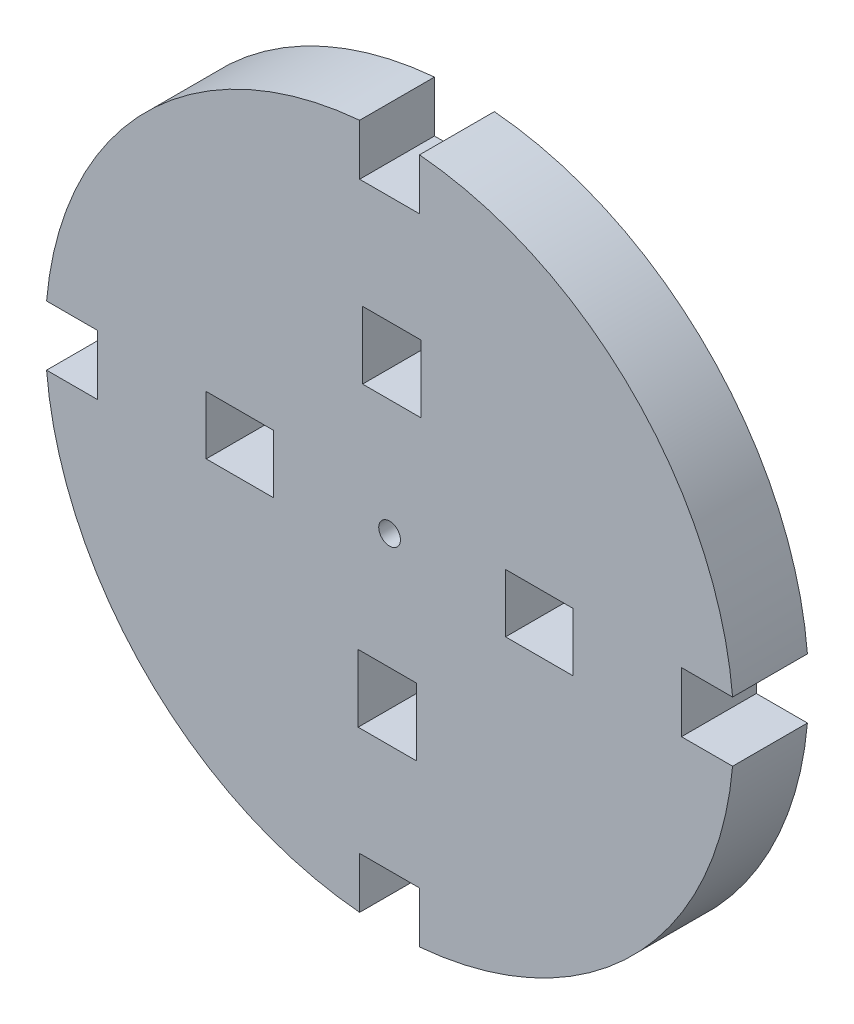
ISO-10303-21;
HEADER;
FILE_DESCRIPTION(('STEP AP214'),'2;1');
FILE_NAME('part.step','',(''),(''),'','','');
FILE_SCHEMA(('AUTOMOTIVE_DESIGN { 1 0 10303 214 1 1 1 1 }'));
ENDSEC;
DATA;
#1=APPLICATION_CONTEXT('core data for automotive mechanical design processes');
#2=APPLICATION_PROTOCOL_DEFINITION('international standard','automotive_design',2000,#1);
#3=PRODUCT_CONTEXT('',#1,'mechanical');
#4=PRODUCT('Part','Part','',(#3));
#5=PRODUCT_RELATED_PRODUCT_CATEGORY('part','',(#4));
#6=PRODUCT_DEFINITION_FORMATION('','',#4);
#7=PRODUCT_DEFINITION_CONTEXT('part definition',#1,'design');
#8=PRODUCT_DEFINITION('design','',#6,#7);
#9=PRODUCT_DEFINITION_SHAPE('','',#8);
#10=(LENGTH_UNIT() NAMED_UNIT(*) SI_UNIT(.MILLI.,.METRE.));
#11=(NAMED_UNIT(*) PLANE_ANGLE_UNIT() SI_UNIT($,.RADIAN.));
#12=(NAMED_UNIT(*) SI_UNIT($,.STERADIAN.) SOLID_ANGLE_UNIT());
#13=UNCERTAINTY_MEASURE_WITH_UNIT(LENGTH_MEASURE(1.E-05),#10,'distance_accuracy_value','');
#14=(GEOMETRIC_REPRESENTATION_CONTEXT(3) GLOBAL_UNCERTAINTY_ASSIGNED_CONTEXT((#13)) GLOBAL_UNIT_ASSIGNED_CONTEXT((#10,
#11,#12)) REPRESENTATION_CONTEXT('',''));
#15=CARTESIAN_POINT('',(0.,0.,0.));
#16=DIRECTION('',(0.,0.,1.));
#17=DIRECTION('',(1.,0.,0.));
#18=AXIS2_PLACEMENT_3D('',#15,#16,#17);
#19=CARTESIAN_POINT('',(0.,0.,5.));
#20=DIRECTION('',(0.,0.,-1.));
#21=DIRECTION('',(-1.,0.,0.));
#22=AXIS2_PLACEMENT_3D('',#19,#20,#21);
#23=CYLINDRICAL_SURFACE('',#22,23.);
#24=CARTESIAN_POINT('',(0.,0.,0.));
#25=DIRECTION('',(0.,0.,1.));
#26=DIRECTION('',(1.,0.,0.));
#27=AXIS2_PLACEMENT_3D('',#24,#25,#26);
#28=CIRCLE('',#27,23.);
#29=CARTESIAN_POINT('',(2.00000000000017,-22.9128784747792,0.));
#30=VERTEX_POINT('',#29);
#31=CARTESIAN_POINT('',(22.9128784747792,-1.99999999999992,0.));
#32=VERTEX_POINT('',#31);
#33=EDGE_CURVE('E501',#30,#32,#28,.T.);
#34=ORIENTED_EDGE('',*,*,#33,.T.);
#35=DIRECTION('',(0.,0.,-1.));
#36=VECTOR('',#35,1.);
#37=CARTESIAN_POINT('',(22.9128784747792,-1.99999999999992,5.));
#38=LINE('',#37,#36);
#39=CARTESIAN_POINT('',(22.9128784747792,-1.99999999999992,5.));
#40=VERTEX_POINT('',#39);
#41=EDGE_CURVE('E11',#32,#40,#38,.F.);
#42=ORIENTED_EDGE('',*,*,#41,.T.);
#43=CARTESIAN_POINT('',(0.,0.,5.));
#44=DIRECTION('',(0.,0.,1.));
#45=DIRECTION('',(1.,0.,0.));
#46=AXIS2_PLACEMENT_3D('',#43,#44,#45);
#47=CIRCLE('',#46,23.);
#48=CARTESIAN_POINT('',(2.00000000000017,-22.9128784747792,5.));
#49=VERTEX_POINT('',#48);
#50=EDGE_CURVE('E522',#49,#40,#47,.T.);
#51=ORIENTED_EDGE('',*,*,#50,.F.);
#52=DIRECTION('',(0.,0.,-1.));
#53=VECTOR('',#52,1.);
#54=CARTESIAN_POINT('',(2.00000000000017,-22.9128784747792,5.));
#55=LINE('',#54,#53);
#56=EDGE_CURVE('E489',#49,#30,#55,.T.);
#57=ORIENTED_EDGE('',*,*,#56,.T.);
#58=EDGE_LOOP('',(#34,#42,#51,#57));
#59=FACE_BOUND('',#58,.T.);
#60=ADVANCED_FACE('F33',(#59),#23,.T.);
#61=CARTESIAN_POINT('',(-22.9128784747792,-2.00000000000009,0.));
#62=VERTEX_POINT('',#61);
#63=CARTESIAN_POINT('',(-1.99999999999983,-22.9128784747792,0.));
#64=VERTEX_POINT('',#63);
#65=EDGE_CURVE('E477',#62,#64,#28,.T.);
#66=ORIENTED_EDGE('',*,*,#65,.T.);
#67=DIRECTION('',(0.,0.,-1.));
#68=VECTOR('',#67,1.);
#69=CARTESIAN_POINT('',(-1.99999999999983,-22.9128784747792,5.));
#70=LINE('',#69,#68);
#71=CARTESIAN_POINT('',(-1.99999999999983,-22.9128784747792,5.));
#72=VERTEX_POINT('',#71);
#73=EDGE_CURVE('E491',#64,#72,#70,.F.);
#74=ORIENTED_EDGE('',*,*,#73,.T.);
#75=CARTESIAN_POINT('',(-22.9128784747792,-2.00000000000009,5.));
#76=VERTEX_POINT('',#75);
#77=EDGE_CURVE('E472',#76,#72,#47,.T.);
#78=ORIENTED_EDGE('',*,*,#77,.F.);
#79=DIRECTION('',(0.,0.,-1.));
#80=VECTOR('',#79,1.);
#81=CARTESIAN_POINT('',(-22.9128784747792,-2.00000000000009,5.));
#82=LINE('',#81,#80);
#83=EDGE_CURVE('E483',#76,#62,#82,.T.);
#84=ORIENTED_EDGE('',*,*,#83,.T.);
#85=EDGE_LOOP('',(#66,#74,#78,#84));
#86=FACE_BOUND('',#85,.T.);
#87=ADVANCED_FACE('F508',(#86),#23,.T.);
#88=CARTESIAN_POINT('',(-2.,22.9128784747792,0.));
#89=VERTEX_POINT('',#88);
#90=CARTESIAN_POINT('',(-22.9128784747792,1.99999999999991,0.));
#91=VERTEX_POINT('',#90);
#92=EDGE_CURVE('E474',#89,#91,#28,.T.);
#93=ORIENTED_EDGE('',*,*,#92,.T.);
#94=DIRECTION('',(0.,0.,-1.));
#95=VECTOR('',#94,1.);
#96=CARTESIAN_POINT('',(-22.9128784747792,1.99999999999991,5.));
#97=LINE('',#96,#95);
#98=CARTESIAN_POINT('',(-22.9128784747792,1.99999999999991,5.));
#99=VERTEX_POINT('',#98);
#100=EDGE_CURVE('E486',#91,#99,#97,.F.);
#101=ORIENTED_EDGE('',*,*,#100,.T.);
#102=CARTESIAN_POINT('',(-2.,22.9128784747792,5.));
#103=VERTEX_POINT('',#102);
#104=EDGE_CURVE('E468',#103,#99,#47,.T.);
#105=ORIENTED_EDGE('',*,*,#104,.F.);
#106=DIRECTION('',(0.,0.,-1.));
#107=VECTOR('',#106,1.);
#108=CARTESIAN_POINT('',(-2.,22.9128784747792,5.));
#109=LINE('',#108,#107);
#110=EDGE_CURVE('E480',#103,#89,#109,.T.);
#111=ORIENTED_EDGE('',*,*,#110,.T.);
#112=EDGE_LOOP('',(#93,#101,#105,#111));
#113=FACE_BOUND('',#112,.T.);
#114=ADVANCED_FACE('F534',(#113),#23,.T.);
#115=CARTESIAN_POINT('',(0.,0.,5.));
#116=DIRECTION('',(0.,0.,1.));
#117=DIRECTION('',(1.,0.,0.));
#118=AXIS2_PLACEMENT_3D('',#115,#116,#117);
#119=PLANE('',#118);
#120=DIRECTION('',(-1.,0.,0.));
#121=VECTOR('',#120,1.);
#122=CARTESIAN_POINT('',(26.5000000000001,-1.99999999999992,5.));
#123=LINE('',#122,#121);
#124=CARTESIAN_POINT('',(19.5000000000001,-1.99999999999992,5.));
#125=VERTEX_POINT('',#124);
#126=EDGE_CURVE('E252',#40,#125,#123,.T.);
#127=ORIENTED_EDGE('',*,*,#126,.T.);
#128=DIRECTION('',(0.,1.,0.));
#129=VECTOR('',#128,1.);
#130=CARTESIAN_POINT('',(19.5000000000001,-1.99999999999992,5.));
#131=LINE('',#130,#129);
#132=CARTESIAN_POINT('',(19.5000000000001,2.00000000000008,5.));
#133=VERTEX_POINT('',#132);
#134=EDGE_CURVE('E247',#125,#133,#131,.T.);
#135=ORIENTED_EDGE('',*,*,#134,.T.);
#136=DIRECTION('',(1.,0.,0.));
#137=VECTOR('',#136,1.);
#138=CARTESIAN_POINT('',(26.5000000000001,2.00000000000008,5.));
#139=LINE('',#138,#137);
#140=CARTESIAN_POINT('',(22.9128784747792,2.00000000000008,5.));
#141=VERTEX_POINT('',#140);
#142=EDGE_CURVE('E255',#133,#141,#139,.T.);
#143=ORIENTED_EDGE('',*,*,#142,.T.);
#144=CARTESIAN_POINT('',(2.,22.9128784747792,5.));
#145=VERTEX_POINT('',#144);
#146=EDGE_CURVE('E473',#141,#145,#47,.T.);
#147=ORIENTED_EDGE('',*,*,#146,.T.);
#148=DIRECTION('',(0.,-1.,0.));
#149=VECTOR('',#148,1.);
#150=CARTESIAN_POINT('',(2.,26.5,5.));
#151=LINE('',#150,#149);
#152=CARTESIAN_POINT('',(2.,19.5,5.));
#153=VERTEX_POINT('',#152);
#154=EDGE_CURVE('E316',#145,#153,#151,.T.);
#155=ORIENTED_EDGE('',*,*,#154,.T.);
#156=DIRECTION('',(-1.,0.,0.));
#157=VECTOR('',#156,1.);
#158=CARTESIAN_POINT('',(2.,19.5,5.));
#159=LINE('',#158,#157);
#160=CARTESIAN_POINT('',(-2.,19.5,5.));
#161=VERTEX_POINT('',#160);
#162=EDGE_CURVE('E320',#153,#161,#159,.T.);
#163=ORIENTED_EDGE('',*,*,#162,.T.);
#164=DIRECTION('',(0.,1.,0.));
#165=VECTOR('',#164,1.);
#166=CARTESIAN_POINT('',(-2.,26.5,5.));
#167=LINE('',#166,#165);
#168=EDGE_CURVE('E313',#161,#103,#167,.T.);
#169=ORIENTED_EDGE('',*,*,#168,.T.);
#170=ORIENTED_EDGE('',*,*,#104,.T.);
#171=DIRECTION('',(1.,0.,0.));
#172=VECTOR('',#171,1.);
#173=CARTESIAN_POINT('',(-26.4999999999999,1.99999999999991,5.));
#174=LINE('',#173,#172);
#175=CARTESIAN_POINT('',(-19.4999999999999,1.99999999999991,5.));
#176=VERTEX_POINT('',#175);
#177=EDGE_CURVE('E299',#99,#176,#174,.T.);
#178=ORIENTED_EDGE('',*,*,#177,.T.);
#179=DIRECTION('',(0.,-1.,0.));
#180=VECTOR('',#179,1.);
#181=CARTESIAN_POINT('',(-19.4999999999999,1.99999999999991,5.));
#182=LINE('',#181,#180);
#183=CARTESIAN_POINT('',(-19.4999999999999,-2.00000000000009,5.));
#184=VERTEX_POINT('',#183);
#185=EDGE_CURVE('E292',#176,#184,#182,.T.);
#186=ORIENTED_EDGE('',*,*,#185,.T.);
#187=DIRECTION('',(-1.,0.,0.));
#188=VECTOR('',#187,1.);
#189=CARTESIAN_POINT('',(-26.4999999999999,-2.00000000000009,5.));
#190=LINE('',#189,#188);
#191=EDGE_CURVE('E295',#184,#76,#190,.T.);
#192=ORIENTED_EDGE('',*,*,#191,.T.);
#193=ORIENTED_EDGE('',*,*,#77,.T.);
#194=DIRECTION('',(0.,1.,0.));
#195=VECTOR('',#194,1.);
#196=CARTESIAN_POINT('',(-1.99999999999983,-26.5,5.));
#197=LINE('',#196,#195);
#198=CARTESIAN_POINT('',(-1.99999999999983,-19.5,5.));
#199=VERTEX_POINT('',#198);
#200=EDGE_CURVE('E279',#72,#199,#197,.T.);
#201=ORIENTED_EDGE('',*,*,#200,.T.);
#202=DIRECTION('',(1.,0.,0.));
#203=VECTOR('',#202,1.);
#204=CARTESIAN_POINT('',(-1.99999999999983,-19.5,5.));
#205=LINE('',#204,#203);
#206=CARTESIAN_POINT('',(2.00000000000017,-19.5,5.));
#207=VERTEX_POINT('',#206);
#208=EDGE_CURVE('E272',#199,#207,#205,.T.);
#209=ORIENTED_EDGE('',*,*,#208,.T.);
#210=DIRECTION('',(0.,-1.,0.));
#211=VECTOR('',#210,1.);
#212=CARTESIAN_POINT('',(2.00000000000017,-26.5,5.));
#213=LINE('',#212,#211);
#214=EDGE_CURVE('E275',#207,#49,#213,.T.);
#215=ORIENTED_EDGE('',*,*,#214,.T.);
#216=ORIENTED_EDGE('',*,*,#50,.T.);
#217=EDGE_LOOP('',(#127,#135,#143,#147,#155,#163,#169,#170,#178,#186,#192,#193,#201,#209,#215,#216));
#218=FACE_BOUND('',#217,.T.);
#219=DIRECTION('',(0.,1.,0.));
#220=VECTOR('',#219,1.);
#221=CARTESIAN_POINT('',(7.74790762909546,-2.09880468468278,5.));
#222=LINE('',#221,#220);
#223=CARTESIAN_POINT('',(7.74790762909546,-2.09880468468278,5.));
#224=VERTEX_POINT('',#223);
#225=CARTESIAN_POINT('',(7.74790762909542,1.80119531531722,5.));
#226=VERTEX_POINT('',#225);
#227=EDGE_CURVE('E334',#224,#226,#222,.T.);
#228=ORIENTED_EDGE('',*,*,#227,.T.);
#229=DIRECTION('',(1.,0.,0.));
#230=VECTOR('',#229,1.);
#231=CARTESIAN_POINT('',(12.2479076290954,1.80119531531727,5.));
#232=LINE('',#231,#230);
#233=CARTESIAN_POINT('',(12.2479076290954,1.80119531531727,5.));
#234=VERTEX_POINT('',#233);
#235=EDGE_CURVE('E337',#226,#234,#232,.T.);
#236=ORIENTED_EDGE('',*,*,#235,.T.);
#237=DIRECTION('',(0.,-1.,0.));
#238=VECTOR('',#237,1.);
#239=CARTESIAN_POINT('',(12.2479076290955,-2.09880468468273,5.));
#240=LINE('',#239,#238);
#241=CARTESIAN_POINT('',(12.2479076290955,-2.09880468468273,5.));
#242=VERTEX_POINT('',#241);
#243=EDGE_CURVE('E341',#234,#242,#240,.T.);
#244=ORIENTED_EDGE('',*,*,#243,.T.);
#245=DIRECTION('',(-1.,0.,0.));
#246=VECTOR('',#245,1.);
#247=CARTESIAN_POINT('',(12.2479076290955,-2.09880468468273,5.));
#248=LINE('',#247,#246);
#249=EDGE_CURVE('E344',#242,#224,#248,.T.);
#250=ORIENTED_EDGE('',*,*,#249,.T.);
#251=EDGE_LOOP('',(#228,#236,#244,#250));
#252=FACE_BOUND('',#251,.T.);
#253=DIRECTION('',(1.,0.,0.));
#254=VECTOR('',#253,1.);
#255=CARTESIAN_POINT('',(-2.09980468468295,-7.74890762909559,5.));
#256=LINE('',#255,#254);
#257=CARTESIAN_POINT('',(-2.09980468468295,-7.74890762909559,5.));
#258=VERTEX_POINT('',#257);
#259=CARTESIAN_POINT('',(1.80019531531705,-7.74890762909556,5.));
#260=VERTEX_POINT('',#259);
#261=EDGE_CURVE('E366',#258,#260,#256,.T.);
#262=ORIENTED_EDGE('',*,*,#261,.T.);
#263=DIRECTION('',(0.,-1.,0.));
#264=VECTOR('',#263,1.);
#265=CARTESIAN_POINT('',(1.80019531531708,-12.2489076290956,5.));
#266=LINE('',#265,#264);
#267=CARTESIAN_POINT('',(1.80019531531708,-12.2489076290956,5.));
#268=VERTEX_POINT('',#267);
#269=EDGE_CURVE('E369',#260,#268,#266,.T.);
#270=ORIENTED_EDGE('',*,*,#269,.T.);
#271=DIRECTION('',(-1.,0.,0.));
#272=VECTOR('',#271,1.);
#273=CARTESIAN_POINT('',(-2.09980468468292,-12.2489076290956,5.));
#274=LINE('',#273,#272);
#275=CARTESIAN_POINT('',(-2.09980468468292,-12.2489076290956,5.));
#276=VERTEX_POINT('',#275);
#277=EDGE_CURVE('E373',#268,#276,#274,.T.);
#278=ORIENTED_EDGE('',*,*,#277,.T.);
#279=DIRECTION('',(0.,1.,0.));
#280=VECTOR('',#279,1.);
#281=CARTESIAN_POINT('',(-2.09980468468292,-12.2489076290956,5.));
#282=LINE('',#281,#280);
#283=EDGE_CURVE('E376',#276,#258,#282,.T.);
#284=ORIENTED_EDGE('',*,*,#283,.T.);
#285=EDGE_LOOP('',(#262,#270,#278,#284));
#286=FACE_BOUND('',#285,.T.);
#287=DIRECTION('',(0.,-1.,0.));
#288=VECTOR('',#287,1.);
#289=CARTESIAN_POINT('',(-7.74990762909572,2.09880468468284,5.));
#290=LINE('',#289,#288);
#291=CARTESIAN_POINT('',(-7.74990762909572,2.09880468468284,5.));
#292=VERTEX_POINT('',#291);
#293=CARTESIAN_POINT('',(-7.74990762909571,-1.80119531531716,5.));
#294=VERTEX_POINT('',#293);
#295=EDGE_CURVE('E398',#292,#294,#290,.T.);
#296=ORIENTED_EDGE('',*,*,#295,.T.);
#297=DIRECTION('',(-1.,0.,0.));
#298=VECTOR('',#297,1.);
#299=CARTESIAN_POINT('',(-12.2499076290957,-1.80119531531718,5.));
#300=LINE('',#299,#298);
#301=CARTESIAN_POINT('',(-12.2499076290957,-1.80119531531718,5.));
#302=VERTEX_POINT('',#301);
#303=EDGE_CURVE('E401',#294,#302,#300,.T.);
#304=ORIENTED_EDGE('',*,*,#303,.T.);
#305=DIRECTION('',(0.,1.,0.));
#306=VECTOR('',#305,1.);
#307=CARTESIAN_POINT('',(-12.2499076290957,2.09880468468282,5.));
#308=LINE('',#307,#306);
#309=CARTESIAN_POINT('',(-12.2499076290957,2.09880468468282,5.));
#310=VERTEX_POINT('',#309);
#311=EDGE_CURVE('E405',#302,#310,#308,.T.);
#312=ORIENTED_EDGE('',*,*,#311,.T.);
#313=DIRECTION('',(1.,0.,0.));
#314=VECTOR('',#313,1.);
#315=CARTESIAN_POINT('',(-12.2499076290957,2.09880468468282,5.));
#316=LINE('',#315,#314);
#317=EDGE_CURVE('E408',#310,#292,#316,.T.);
#318=ORIENTED_EDGE('',*,*,#317,.T.);
#319=EDGE_LOOP('',(#296,#304,#312,#318));
#320=FACE_BOUND('',#319,.T.);
#321=DIRECTION('',(0.,1.,0.));
#322=VECTOR('',#321,1.);
#323=CARTESIAN_POINT('',(-1.80219531531727,12.2489076290956,5.));
#324=LINE('',#323,#322);
#325=CARTESIAN_POINT('',(-1.80219531531727,7.74890762909558,5.));
#326=VERTEX_POINT('',#325);
#327=CARTESIAN_POINT('',(-1.80219531531727,12.2489076290956,5.));
#328=VERTEX_POINT('',#327);
#329=EDGE_CURVE('E430',#326,#328,#324,.T.);
#330=ORIENTED_EDGE('',*,*,#329,.T.);
#331=DIRECTION('',(1.,0.,0.));
#332=VECTOR('',#331,1.);
#333=CARTESIAN_POINT('',(2.09780468468273,12.2489076290956,5.));
#334=LINE('',#333,#332);
#335=CARTESIAN_POINT('',(2.09780468468273,12.2489076290956,5.));
#336=VERTEX_POINT('',#335);
#337=EDGE_CURVE('E433',#328,#336,#334,.T.);
#338=ORIENTED_EDGE('',*,*,#337,.T.);
#339=DIRECTION('',(0.,-1.,0.));
#340=VECTOR('',#339,1.);
#341=CARTESIAN_POINT('',(2.09780468468273,12.2489076290956,5.));
#342=LINE('',#341,#340);
#343=CARTESIAN_POINT('',(2.09780468468273,7.74890762909558,5.));
#344=VERTEX_POINT('',#343);
#345=EDGE_CURVE('E437',#336,#344,#342,.T.);
#346=ORIENTED_EDGE('',*,*,#345,.T.);
#347=DIRECTION('',(-1.,0.,0.));
#348=VECTOR('',#347,1.);
#349=CARTESIAN_POINT('',(2.09780468468273,7.74890762909558,5.));
#350=LINE('',#349,#348);
#351=EDGE_CURVE('E440',#344,#326,#350,.T.);
#352=ORIENTED_EDGE('',*,*,#351,.T.);
#353=EDGE_LOOP('',(#330,#338,#346,#352));
#354=FACE_BOUND('',#353,.T.);
#355=CARTESIAN_POINT('',(0.,0.,5.));
#356=DIRECTION('',(0.,0.,1.));
#357=DIRECTION('',(1.,0.,0.));
#358=AXIS2_PLACEMENT_3D('',#355,#356,#357);
#359=CIRCLE('',#358,0.725);
#360=CARTESIAN_POINT('',(0.725,0.,5.));
#361=VERTEX_POINT('',#360);
#362=EDGE_CURVE('E462',#361,#361,#359,.T.);
#363=ORIENTED_EDGE('',*,*,#362,.F.);
#364=EDGE_LOOP('',(#363));
#365=FACE_BOUND('',#364,.T.);
#366=ADVANCED_FACE('F260',(#218,#252,#286,#320,#354,#365),#119,.T.);
#367=CARTESIAN_POINT('',(0.,0.,0.));
#368=DIRECTION('',(0.,0.,1.));
#369=DIRECTION('',(1.,0.,0.));
#370=AXIS2_PLACEMENT_3D('',#367,#368,#369);
#371=PLANE('',#370);
#372=DIRECTION('',(1.,0.,0.));
#373=VECTOR('',#372,1.);
#374=CARTESIAN_POINT('',(12.2479076290954,1.80119531531727,0.));
#375=LINE('',#374,#373);
#376=CARTESIAN_POINT('',(7.74790762909542,1.80119531531722,0.));
#377=VERTEX_POINT('',#376);
#378=CARTESIAN_POINT('',(12.2479076290954,1.80119531531727,0.));
#379=VERTEX_POINT('',#378);
#380=EDGE_CURVE('E349',#377,#379,#375,.T.);
#381=ORIENTED_EDGE('',*,*,#380,.F.);
#382=DIRECTION('',(0.,1.,0.));
#383=VECTOR('',#382,1.);
#384=CARTESIAN_POINT('',(7.74790762909546,-2.09880468468278,0.));
#385=LINE('',#384,#383);
#386=CARTESIAN_POINT('',(7.74790762909546,-2.09880468468278,0.));
#387=VERTEX_POINT('',#386);
#388=EDGE_CURVE('E331',#387,#377,#385,.T.);
#389=ORIENTED_EDGE('',*,*,#388,.F.);
#390=DIRECTION('',(-1.,0.,0.));
#391=VECTOR('',#390,1.);
#392=CARTESIAN_POINT('',(12.2479076290955,-2.09880468468273,0.));
#393=LINE('',#392,#391);
#394=CARTESIAN_POINT('',(12.2479076290955,-2.09880468468273,0.));
#395=VERTEX_POINT('',#394);
#396=EDGE_CURVE('E338',#395,#387,#393,.T.);
#397=ORIENTED_EDGE('',*,*,#396,.F.);
#398=DIRECTION('',(0.,-1.,0.));
#399=VECTOR('',#398,1.);
#400=CARTESIAN_POINT('',(12.2479076290955,-2.09880468468273,0.));
#401=LINE('',#400,#399);
#402=EDGE_CURVE('E352',#379,#395,#401,.T.);
#403=ORIENTED_EDGE('',*,*,#402,.F.);
#404=EDGE_LOOP('',(#381,#389,#397,#403));
#405=FACE_BOUND('',#404,.T.);
#406=DIRECTION('',(0.,-1.,0.));
#407=VECTOR('',#406,1.);
#408=CARTESIAN_POINT('',(1.80019531531708,-12.2489076290956,0.));
#409=LINE('',#408,#407);
#410=CARTESIAN_POINT('',(1.80019531531705,-7.74890762909556,0.));
#411=VERTEX_POINT('',#410);
#412=CARTESIAN_POINT('',(1.80019531531708,-12.2489076290956,0.));
#413=VERTEX_POINT('',#412);
#414=EDGE_CURVE('E381',#411,#413,#409,.T.);
#415=ORIENTED_EDGE('',*,*,#414,.F.);
#416=DIRECTION('',(1.,0.,0.));
#417=VECTOR('',#416,1.);
#418=CARTESIAN_POINT('',(-2.09980468468295,-7.74890762909559,0.));
#419=LINE('',#418,#417);
#420=CARTESIAN_POINT('',(-2.09980468468295,-7.74890762909559,0.));
#421=VERTEX_POINT('',#420);
#422=EDGE_CURVE('E359',#421,#411,#419,.T.);
#423=ORIENTED_EDGE('',*,*,#422,.F.);
#424=DIRECTION('',(0.,1.,0.));
#425=VECTOR('',#424,1.);
#426=CARTESIAN_POINT('',(-2.09980468468292,-12.2489076290956,0.));
#427=LINE('',#426,#425);
#428=CARTESIAN_POINT('',(-2.09980468468292,-12.2489076290956,0.));
#429=VERTEX_POINT('',#428);
#430=EDGE_CURVE('E370',#429,#421,#427,.T.);
#431=ORIENTED_EDGE('',*,*,#430,.F.);
#432=DIRECTION('',(-1.,0.,0.));
#433=VECTOR('',#432,1.);
#434=CARTESIAN_POINT('',(-2.09980468468292,-12.2489076290956,0.));
#435=LINE('',#434,#433);
#436=EDGE_CURVE('E384',#413,#429,#435,.T.);
#437=ORIENTED_EDGE('',*,*,#436,.F.);
#438=EDGE_LOOP('',(#415,#423,#431,#437));
#439=FACE_BOUND('',#438,.T.);
#440=DIRECTION('',(-1.,0.,0.));
#441=VECTOR('',#440,1.);
#442=CARTESIAN_POINT('',(-12.2499076290957,-1.80119531531718,0.));
#443=LINE('',#442,#441);
#444=CARTESIAN_POINT('',(-7.74990762909571,-1.80119531531716,0.));
#445=VERTEX_POINT('',#444);
#446=CARTESIAN_POINT('',(-12.2499076290957,-1.80119531531718,0.));
#447=VERTEX_POINT('',#446);
#448=EDGE_CURVE('E413',#445,#447,#443,.T.);
#449=ORIENTED_EDGE('',*,*,#448,.F.);
#450=DIRECTION('',(0.,-1.,0.));
#451=VECTOR('',#450,1.);
#452=CARTESIAN_POINT('',(-7.74990762909572,2.09880468468284,0.));
#453=LINE('',#452,#451);
#454=CARTESIAN_POINT('',(-7.74990762909572,2.09880468468284,0.));
#455=VERTEX_POINT('',#454);
#456=EDGE_CURVE('E391',#455,#445,#453,.T.);
#457=ORIENTED_EDGE('',*,*,#456,.F.);
#458=DIRECTION('',(1.,0.,0.));
#459=VECTOR('',#458,1.);
#460=CARTESIAN_POINT('',(-12.2499076290957,2.09880468468282,0.));
#461=LINE('',#460,#459);
#462=CARTESIAN_POINT('',(-12.2499076290957,2.09880468468282,0.));
#463=VERTEX_POINT('',#462);
#464=EDGE_CURVE('E402',#463,#455,#461,.T.);
#465=ORIENTED_EDGE('',*,*,#464,.F.);
#466=DIRECTION('',(0.,1.,0.));
#467=VECTOR('',#466,1.);
#468=CARTESIAN_POINT('',(-12.2499076290957,2.09880468468282,0.));
#469=LINE('',#468,#467);
#470=EDGE_CURVE('E416',#447,#463,#469,.T.);
#471=ORIENTED_EDGE('',*,*,#470,.F.);
#472=EDGE_LOOP('',(#449,#457,#465,#471));
#473=FACE_BOUND('',#472,.T.);
#474=DIRECTION('',(1.,0.,0.));
#475=VECTOR('',#474,1.);
#476=CARTESIAN_POINT('',(2.09780468468273,12.2489076290956,0.));
#477=LINE('',#476,#475);
#478=CARTESIAN_POINT('',(-1.80219531531727,12.2489076290956,0.));
#479=VERTEX_POINT('',#478);
#480=CARTESIAN_POINT('',(2.09780468468273,12.2489076290956,0.));
#481=VERTEX_POINT('',#480);
#482=EDGE_CURVE('E445',#479,#481,#477,.T.);
#483=ORIENTED_EDGE('',*,*,#482,.F.);
#484=DIRECTION('',(0.,1.,0.));
#485=VECTOR('',#484,1.);
#486=CARTESIAN_POINT('',(-1.80219531531727,12.2489076290956,0.));
#487=LINE('',#486,#485);
#488=CARTESIAN_POINT('',(-1.80219531531727,7.74890762909558,0.));
#489=VERTEX_POINT('',#488);
#490=EDGE_CURVE('E423',#489,#479,#487,.T.);
#491=ORIENTED_EDGE('',*,*,#490,.F.);
#492=DIRECTION('',(-1.,0.,0.));
#493=VECTOR('',#492,1.);
#494=CARTESIAN_POINT('',(2.09780468468273,7.74890762909558,0.));
#495=LINE('',#494,#493);
#496=CARTESIAN_POINT('',(2.09780468468273,7.74890762909558,0.));
#497=VERTEX_POINT('',#496);
#498=EDGE_CURVE('E434',#497,#489,#495,.T.);
#499=ORIENTED_EDGE('',*,*,#498,.F.);
#500=DIRECTION('',(0.,-1.,0.));
#501=VECTOR('',#500,1.);
#502=CARTESIAN_POINT('',(2.09780468468273,12.2489076290956,0.));
#503=LINE('',#502,#501);
#504=EDGE_CURVE('E448',#481,#497,#503,.T.);
#505=ORIENTED_EDGE('',*,*,#504,.F.);
#506=EDGE_LOOP('',(#483,#491,#499,#505));
#507=FACE_BOUND('',#506,.T.);
#508=DIRECTION('',(0.,1.,0.));
#509=VECTOR('',#508,1.);
#510=CARTESIAN_POINT('',(19.5000000000001,-1.99999999999992,0.));
#511=LINE('',#510,#509);
#512=CARTESIAN_POINT('',(19.5000000000001,-1.99999999999992,0.));
#513=VERTEX_POINT('',#512);
#514=CARTESIAN_POINT('',(19.5000000000001,2.00000000000008,0.));
#515=VERTEX_POINT('',#514);
#516=EDGE_CURVE('E250',#513,#515,#511,.T.);
#517=ORIENTED_EDGE('',*,*,#516,.F.);
#518=DIRECTION('',(-1.,0.,0.));
#519=VECTOR('',#518,1.);
#520=CARTESIAN_POINT('',(26.5000000000001,-1.99999999999992,0.));
#521=LINE('',#520,#519);
#522=EDGE_CURVE('E263',#32,#513,#521,.T.);
#523=ORIENTED_EDGE('',*,*,#522,.F.);
#524=ORIENTED_EDGE('',*,*,#33,.F.);
#525=DIRECTION('',(0.,-1.,0.));
#526=VECTOR('',#525,1.);
#527=CARTESIAN_POINT('',(2.00000000000017,-26.5,0.));
#528=LINE('',#527,#526);
#529=CARTESIAN_POINT('',(2.00000000000017,-19.5,0.));
#530=VERTEX_POINT('',#529);
#531=EDGE_CURVE('E56',#530,#30,#528,.T.);
#532=ORIENTED_EDGE('',*,*,#531,.F.);
#533=DIRECTION('',(1.,0.,0.));
#534=VECTOR('',#533,1.);
#535=CARTESIAN_POINT('',(-1.99999999999983,-19.5,0.));
#536=LINE('',#535,#534);
#537=CARTESIAN_POINT('',(-1.99999999999983,-19.5,0.));
#538=VERTEX_POINT('',#537);
#539=EDGE_CURVE('E270',#538,#530,#536,.T.);
#540=ORIENTED_EDGE('',*,*,#539,.F.);
#541=DIRECTION('',(0.,1.,0.));
#542=VECTOR('',#541,1.);
#543=CARTESIAN_POINT('',(-1.99999999999983,-26.5,0.));
#544=LINE('',#543,#542);
#545=EDGE_CURVE('E276',#64,#538,#544,.T.);
#546=ORIENTED_EDGE('',*,*,#545,.F.);
#547=ORIENTED_EDGE('',*,*,#65,.F.);
#548=DIRECTION('',(-1.,0.,0.));
#549=VECTOR('',#548,1.);
#550=CARTESIAN_POINT('',(-26.4999999999999,-2.00000000000009,0.));
#551=LINE('',#550,#549);
#552=CARTESIAN_POINT('',(-19.4999999999999,-2.00000000000009,0.));
#553=VERTEX_POINT('',#552);
#554=EDGE_CURVE('E305',#553,#62,#551,.T.);
#555=ORIENTED_EDGE('',*,*,#554,.F.);
#556=DIRECTION('',(0.,-1.,0.));
#557=VECTOR('',#556,1.);
#558=CARTESIAN_POINT('',(-19.4999999999999,1.99999999999991,0.));
#559=LINE('',#558,#557);
#560=CARTESIAN_POINT('',(-19.4999999999999,1.99999999999991,0.));
#561=VERTEX_POINT('',#560);
#562=EDGE_CURVE('E290',#561,#553,#559,.T.);
#563=ORIENTED_EDGE('',*,*,#562,.F.);
#564=DIRECTION('',(1.,0.,0.));
#565=VECTOR('',#564,1.);
#566=CARTESIAN_POINT('',(-26.4999999999999,1.99999999999991,0.));
#567=LINE('',#566,#565);
#568=EDGE_CURVE('E296',#91,#561,#567,.T.);
#569=ORIENTED_EDGE('',*,*,#568,.F.);
#570=ORIENTED_EDGE('',*,*,#92,.F.);
#571=DIRECTION('',(0.,1.,0.));
#572=VECTOR('',#571,1.);
#573=CARTESIAN_POINT('',(-2.,26.5,0.));
#574=LINE('',#573,#572);
#575=CARTESIAN_POINT('',(-2.,19.5,0.));
#576=VERTEX_POINT('',#575);
#577=EDGE_CURVE('E311',#576,#89,#574,.T.);
#578=ORIENTED_EDGE('',*,*,#577,.F.);
#579=DIRECTION('',(-1.,0.,0.));
#580=VECTOR('',#579,1.);
#581=CARTESIAN_POINT('',(2.,19.5,0.));
#582=LINE('',#581,#580);
#583=CARTESIAN_POINT('',(2.,19.5,0.));
#584=VERTEX_POINT('',#583);
#585=EDGE_CURVE('E317',#584,#576,#582,.T.);
#586=ORIENTED_EDGE('',*,*,#585,.F.);
#587=DIRECTION('',(0.,-1.,0.));
#588=VECTOR('',#587,1.);
#589=CARTESIAN_POINT('',(2.,26.5,0.));
#590=LINE('',#589,#588);
#591=CARTESIAN_POINT('',(2.,22.9128784747792,0.));
#592=VERTEX_POINT('',#591);
#593=EDGE_CURVE('E325',#592,#584,#590,.T.);
#594=ORIENTED_EDGE('',*,*,#593,.F.);
#595=CARTESIAN_POINT('',(22.9128784747792,2.00000000000008,0.));
#596=VERTEX_POINT('',#595);
#597=EDGE_CURVE('E465',#596,#592,#28,.T.);
#598=ORIENTED_EDGE('',*,*,#597,.F.);
#599=DIRECTION('',(1.,0.,0.));
#600=VECTOR('',#599,1.);
#601=CARTESIAN_POINT('',(26.5000000000001,2.00000000000008,0.));
#602=LINE('',#601,#600);
#603=EDGE_CURVE('E48',#515,#596,#602,.T.);
#604=ORIENTED_EDGE('',*,*,#603,.F.);
#605=EDGE_LOOP('',(#517,#523,#524,#532,#540,#546,#547,#555,#563,#569,#570,#578,#586,#594,#598,#604));
#606=FACE_BOUND('',#605,.T.);
#607=CARTESIAN_POINT('',(0.,0.,0.));
#608=DIRECTION('',(0.,0.,1.));
#609=DIRECTION('',(1.,0.,0.));
#610=AXIS2_PLACEMENT_3D('',#607,#608,#609);
#611=CIRCLE('',#610,0.725);
#612=CARTESIAN_POINT('',(0.725,0.,0.));
#613=VERTEX_POINT('',#612);
#614=EDGE_CURVE('E455',#613,#613,#611,.T.);
#615=ORIENTED_EDGE('',*,*,#614,.T.);
#616=EDGE_LOOP('',(#615));
#617=FACE_BOUND('',#616,.T.);
#618=ADVANCED_FACE('F498',(#405,#439,#473,#507,#606,#617),#371,.F.);
#619=ORIENTED_EDGE('',*,*,#146,.F.);
#620=DIRECTION('',(0.,0.,-1.));
#621=VECTOR('',#620,1.);
#622=CARTESIAN_POINT('',(22.9128784747792,2.00000000000008,5.));
#623=LINE('',#622,#621);
#624=EDGE_CURVE('E41',#141,#596,#623,.T.);
#625=ORIENTED_EDGE('',*,*,#624,.T.);
#626=ORIENTED_EDGE('',*,*,#597,.T.);
#627=DIRECTION('',(0.,0.,-1.));
#628=VECTOR('',#627,1.);
#629=CARTESIAN_POINT('',(2.,22.9128784747792,5.));
#630=LINE('',#629,#628);
#631=EDGE_CURVE('E471',#592,#145,#630,.F.);
#632=ORIENTED_EDGE('',*,*,#631,.T.);
#633=EDGE_LOOP('',(#619,#625,#626,#632));
#634=FACE_BOUND('',#633,.T.);
#635=ADVANCED_FACE('F35',(#634),#23,.T.);
#636=CARTESIAN_POINT('',(0.,0.,5.));
#637=DIRECTION('',(0.,0.,-1.));
#638=DIRECTION('',(-1.,0.,0.));
#639=AXIS2_PLACEMENT_3D('',#636,#637,#638);
#640=CYLINDRICAL_SURFACE('',#639,0.725);
#641=ORIENTED_EDGE('',*,*,#362,.T.);
#642=EDGE_LOOP('',(#641));
#643=FACE_BOUND('',#642,.T.);
#644=ORIENTED_EDGE('',*,*,#614,.F.);
#645=EDGE_LOOP('',(#644));
#646=FACE_BOUND('',#645,.T.);
#647=ADVANCED_FACE('F558',(#643,#646),#640,.F.);
#648=CARTESIAN_POINT('',(-1.80219531531727,12.2489076290956,5.));
#649=DIRECTION('',(-1.,0.,0.));
#650=DIRECTION('',(0.,-1.,0.));
#651=AXIS2_PLACEMENT_3D('',#648,#649,#650);
#652=PLANE('',#651);
#653=ORIENTED_EDGE('',*,*,#490,.T.);
#654=DIRECTION('',(0.,0.,-1.));
#655=VECTOR('',#654,1.);
#656=CARTESIAN_POINT('',(-1.80219531531727,12.2489076290956,5.));
#657=LINE('',#656,#655);
#658=EDGE_CURVE('E443',#328,#479,#657,.T.);
#659=ORIENTED_EDGE('',*,*,#658,.F.);
#660=ORIENTED_EDGE('',*,*,#329,.F.);
#661=DIRECTION('',(0.,0.,-1.));
#662=VECTOR('',#661,1.);
#663=CARTESIAN_POINT('',(-1.80219531531727,7.74890762909558,5.));
#664=LINE('',#663,#662);
#665=EDGE_CURVE('E453',#326,#489,#664,.T.);
#666=ORIENTED_EDGE('',*,*,#665,.T.);
#667=EDGE_LOOP('',(#653,#659,#660,#666));
#668=FACE_BOUND('',#667,.T.);
#669=ADVANCED_FACE('F563',(#668),#652,.F.);
#670=CARTESIAN_POINT('',(2.09780468468273,7.74890762909558,5.));
#671=DIRECTION('',(0.,-1.,0.));
#672=DIRECTION('',(0.,0.,-1.));
#673=AXIS2_PLACEMENT_3D('',#670,#671,#672);
#674=PLANE('',#673);
#675=ORIENTED_EDGE('',*,*,#498,.T.);
#676=ORIENTED_EDGE('',*,*,#665,.F.);
#677=ORIENTED_EDGE('',*,*,#351,.F.);
#678=DIRECTION('',(0.,0.,-1.));
#679=VECTOR('',#678,1.);
#680=CARTESIAN_POINT('',(2.09780468468273,7.74890762909558,5.));
#681=LINE('',#680,#679);
#682=EDGE_CURVE('E456',#344,#497,#681,.T.);
#683=ORIENTED_EDGE('',*,*,#682,.T.);
#684=EDGE_LOOP('',(#675,#676,#677,#683));
#685=FACE_BOUND('',#684,.T.);
#686=ADVANCED_FACE('F577',(#685),#674,.F.);
#687=CARTESIAN_POINT('',(2.09780468468273,12.2489076290956,5.));
#688=DIRECTION('',(1.,0.,0.));
#689=DIRECTION('',(0.,1.,0.));
#690=AXIS2_PLACEMENT_3D('',#687,#688,#689);
#691=PLANE('',#690);
#692=ORIENTED_EDGE('',*,*,#504,.T.);
#693=ORIENTED_EDGE('',*,*,#682,.F.);
#694=ORIENTED_EDGE('',*,*,#345,.F.);
#695=DIRECTION('',(0.,0.,-1.));
#696=VECTOR('',#695,1.);
#697=CARTESIAN_POINT('',(2.09780468468273,12.2489076290956,5.));
#698=LINE('',#697,#696);
#699=EDGE_CURVE('E458',#336,#481,#698,.T.);
#700=ORIENTED_EDGE('',*,*,#699,.T.);
#701=EDGE_LOOP('',(#692,#693,#694,#700));
#702=FACE_BOUND('',#701,.T.);
#703=ADVANCED_FACE('F583',(#702),#691,.F.);
#704=CARTESIAN_POINT('',(2.09780468468273,12.2489076290956,5.));
#705=DIRECTION('',(0.,1.,0.));
#706=DIRECTION('',(0.,0.,1.));
#707=AXIS2_PLACEMENT_3D('',#704,#705,#706);
#708=PLANE('',#707);
#709=ORIENTED_EDGE('',*,*,#482,.T.);
#710=ORIENTED_EDGE('',*,*,#699,.F.);
#711=ORIENTED_EDGE('',*,*,#337,.F.);
#712=ORIENTED_EDGE('',*,*,#658,.T.);
#713=EDGE_LOOP('',(#709,#710,#711,#712));
#714=FACE_BOUND('',#713,.T.);
#715=ADVANCED_FACE('F579',(#714),#708,.F.);
#716=CARTESIAN_POINT('',(-7.74990762909572,2.09880468468284,5.));
#717=DIRECTION('',(1.,0.,0.));
#718=DIRECTION('',(0.,1.,0.));
#719=AXIS2_PLACEMENT_3D('',#716,#717,#718);
#720=PLANE('',#719);
#721=ORIENTED_EDGE('',*,*,#456,.T.);
#722=DIRECTION('',(0.,0.,-1.));
#723=VECTOR('',#722,1.);
#724=CARTESIAN_POINT('',(-7.74990762909571,-1.80119531531716,5.));
#725=LINE('',#724,#723);
#726=EDGE_CURVE('E411',#294,#445,#725,.T.);
#727=ORIENTED_EDGE('',*,*,#726,.F.);
#728=ORIENTED_EDGE('',*,*,#295,.F.);
#729=DIRECTION('',(0.,0.,-1.));
#730=VECTOR('',#729,1.);
#731=CARTESIAN_POINT('',(-7.74990762909572,2.09880468468284,5.));
#732=LINE('',#731,#730);
#733=EDGE_CURVE('E421',#292,#455,#732,.T.);
#734=ORIENTED_EDGE('',*,*,#733,.T.);
#735=EDGE_LOOP('',(#721,#727,#728,#734));
#736=FACE_BOUND('',#735,.T.);
#737=ADVANCED_FACE('F582',(#736),#720,.F.);
#738=CARTESIAN_POINT('',(-12.2499076290957,2.09880468468282,5.));
#739=DIRECTION('',(0.,1.,0.));
#740=DIRECTION('',(-1.,0.,0.));
#741=AXIS2_PLACEMENT_3D('',#738,#739,#740);
#742=PLANE('',#741);
#743=ORIENTED_EDGE('',*,*,#464,.T.);
#744=ORIENTED_EDGE('',*,*,#733,.F.);
#745=ORIENTED_EDGE('',*,*,#317,.F.);
#746=DIRECTION('',(0.,0.,-1.));
#747=VECTOR('',#746,1.);
#748=CARTESIAN_POINT('',(-12.2499076290957,2.09880468468282,5.));
#749=LINE('',#748,#747);
#750=EDGE_CURVE('E424',#310,#463,#749,.T.);
#751=ORIENTED_EDGE('',*,*,#750,.T.);
#752=EDGE_LOOP('',(#743,#744,#745,#751));
#753=FACE_BOUND('',#752,.T.);
#754=ADVANCED_FACE('F593',(#753),#742,.F.);
#755=CARTESIAN_POINT('',(-12.2499076290957,2.09880468468282,5.));
#756=DIRECTION('',(-1.,0.,0.));
#757=DIRECTION('',(0.,-1.,0.));
#758=AXIS2_PLACEMENT_3D('',#755,#756,#757);
#759=PLANE('',#758);
#760=ORIENTED_EDGE('',*,*,#470,.T.);
#761=ORIENTED_EDGE('',*,*,#750,.F.);
#762=ORIENTED_EDGE('',*,*,#311,.F.);
#763=DIRECTION('',(0.,0.,-1.));
#764=VECTOR('',#763,1.);
#765=CARTESIAN_POINT('',(-12.2499076290957,-1.80119531531718,5.));
#766=LINE('',#765,#764);
#767=EDGE_CURVE('E426',#302,#447,#766,.T.);
#768=ORIENTED_EDGE('',*,*,#767,.T.);
#769=EDGE_LOOP('',(#760,#761,#762,#768));
#770=FACE_BOUND('',#769,.T.);
#771=ADVANCED_FACE('F599',(#770),#759,.F.);
#772=CARTESIAN_POINT('',(-12.2499076290957,-1.80119531531718,5.));
#773=DIRECTION('',(0.,-1.,0.));
#774=DIRECTION('',(1.,0.,0.));
#775=AXIS2_PLACEMENT_3D('',#772,#773,#774);
#776=PLANE('',#775);
#777=ORIENTED_EDGE('',*,*,#448,.T.);
#778=ORIENTED_EDGE('',*,*,#767,.F.);
#779=ORIENTED_EDGE('',*,*,#303,.F.);
#780=ORIENTED_EDGE('',*,*,#726,.T.);
#781=EDGE_LOOP('',(#777,#778,#779,#780));
#782=FACE_BOUND('',#781,.T.);
#783=ADVANCED_FACE('F595',(#782),#776,.F.);
#784=CARTESIAN_POINT('',(-2.09980468468295,-7.74890762909559,5.));
#785=DIRECTION('',(0.,1.,0.));
#786=DIRECTION('',(-1.,0.,0.));
#787=AXIS2_PLACEMENT_3D('',#784,#785,#786);
#788=PLANE('',#787);
#789=ORIENTED_EDGE('',*,*,#422,.T.);
#790=DIRECTION('',(0.,0.,-1.));
#791=VECTOR('',#790,1.);
#792=CARTESIAN_POINT('',(1.80019531531705,-7.74890762909556,5.));
#793=LINE('',#792,#791);
#794=EDGE_CURVE('E379',#260,#411,#793,.T.);
#795=ORIENTED_EDGE('',*,*,#794,.F.);
#796=ORIENTED_EDGE('',*,*,#261,.F.);
#797=DIRECTION('',(0.,0.,-1.));
#798=VECTOR('',#797,1.);
#799=CARTESIAN_POINT('',(-2.09980468468295,-7.74890762909559,5.));
#800=LINE('',#799,#798);
#801=EDGE_CURVE('E389',#258,#421,#800,.T.);
#802=ORIENTED_EDGE('',*,*,#801,.T.);
#803=EDGE_LOOP('',(#789,#795,#796,#802));
#804=FACE_BOUND('',#803,.T.);
#805=ADVANCED_FACE('F598',(#804),#788,.F.);
#806=CARTESIAN_POINT('',(-2.09980468468292,-12.2489076290956,5.));
#807=DIRECTION('',(-1.,0.,0.));
#808=DIRECTION('',(0.,-1.,0.));
#809=AXIS2_PLACEMENT_3D('',#806,#807,#808);
#810=PLANE('',#809);
#811=ORIENTED_EDGE('',*,*,#430,.T.);
#812=ORIENTED_EDGE('',*,*,#801,.F.);
#813=ORIENTED_EDGE('',*,*,#283,.F.);
#814=DIRECTION('',(0.,0.,-1.));
#815=VECTOR('',#814,1.);
#816=CARTESIAN_POINT('',(-2.09980468468292,-12.2489076290956,5.));
#817=LINE('',#816,#815);
#818=EDGE_CURVE('E392',#276,#429,#817,.T.);
#819=ORIENTED_EDGE('',*,*,#818,.T.);
#820=EDGE_LOOP('',(#811,#812,#813,#819));
#821=FACE_BOUND('',#820,.T.);
#822=ADVANCED_FACE('F609',(#821),#810,.F.);
#823=CARTESIAN_POINT('',(-2.09980468468292,-12.2489076290956,5.));
#824=DIRECTION('',(0.,-1.,0.));
#825=DIRECTION('',(1.,0.,0.));
#826=AXIS2_PLACEMENT_3D('',#823,#824,#825);
#827=PLANE('',#826);
#828=ORIENTED_EDGE('',*,*,#436,.T.);
#829=ORIENTED_EDGE('',*,*,#818,.F.);
#830=ORIENTED_EDGE('',*,*,#277,.F.);
#831=DIRECTION('',(0.,0.,-1.));
#832=VECTOR('',#831,1.);
#833=CARTESIAN_POINT('',(1.80019531531708,-12.2489076290956,5.));
#834=LINE('',#833,#832);
#835=EDGE_CURVE('E394',#268,#413,#834,.T.);
#836=ORIENTED_EDGE('',*,*,#835,.T.);
#837=EDGE_LOOP('',(#828,#829,#830,#836));
#838=FACE_BOUND('',#837,.T.);
#839=ADVANCED_FACE('F615',(#838),#827,.F.);
#840=CARTESIAN_POINT('',(1.80019531531708,-12.2489076290956,5.));
#841=DIRECTION('',(1.,0.,0.));
#842=DIRECTION('',(0.,1.,0.));
#843=AXIS2_PLACEMENT_3D('',#840,#841,#842);
#844=PLANE('',#843);
#845=ORIENTED_EDGE('',*,*,#414,.T.);
#846=ORIENTED_EDGE('',*,*,#835,.F.);
#847=ORIENTED_EDGE('',*,*,#269,.F.);
#848=ORIENTED_EDGE('',*,*,#794,.T.);
#849=EDGE_LOOP('',(#845,#846,#847,#848));
#850=FACE_BOUND('',#849,.T.);
#851=ADVANCED_FACE('F611',(#850),#844,.F.);
#852=CARTESIAN_POINT('',(7.74790762909546,-2.09880468468278,5.));
#853=DIRECTION('',(-1.,0.,0.));
#854=DIRECTION('',(0.,-1.,0.));
#855=AXIS2_PLACEMENT_3D('',#852,#853,#854);
#856=PLANE('',#855);
#857=ORIENTED_EDGE('',*,*,#388,.T.);
#858=DIRECTION('',(0.,0.,-1.));
#859=VECTOR('',#858,1.);
#860=CARTESIAN_POINT('',(7.74790762909542,1.80119531531722,5.));
#861=LINE('',#860,#859);
#862=EDGE_CURVE('E347',#226,#377,#861,.T.);
#863=ORIENTED_EDGE('',*,*,#862,.F.);
#864=ORIENTED_EDGE('',*,*,#227,.F.);
#865=DIRECTION('',(0.,0.,-1.));
#866=VECTOR('',#865,1.);
#867=CARTESIAN_POINT('',(7.74790762909546,-2.09880468468278,5.));
#868=LINE('',#867,#866);
#869=EDGE_CURVE('E357',#224,#387,#868,.T.);
#870=ORIENTED_EDGE('',*,*,#869,.T.);
#871=EDGE_LOOP('',(#857,#863,#864,#870));
#872=FACE_BOUND('',#871,.T.);
#873=ADVANCED_FACE('F614',(#872),#856,.F.);
#874=CARTESIAN_POINT('',(12.2479076290955,-2.09880468468273,5.));
#875=DIRECTION('',(0.,-1.,0.));
#876=DIRECTION('',(1.,0.,0.));
#877=AXIS2_PLACEMENT_3D('',#874,#875,#876);
#878=PLANE('',#877);
#879=ORIENTED_EDGE('',*,*,#396,.T.);
#880=ORIENTED_EDGE('',*,*,#869,.F.);
#881=ORIENTED_EDGE('',*,*,#249,.F.);
#882=DIRECTION('',(0.,0.,-1.));
#883=VECTOR('',#882,1.);
#884=CARTESIAN_POINT('',(12.2479076290955,-2.09880468468273,5.));
#885=LINE('',#884,#883);
#886=EDGE_CURVE('E360',#242,#395,#885,.T.);
#887=ORIENTED_EDGE('',*,*,#886,.T.);
#888=EDGE_LOOP('',(#879,#880,#881,#887));
#889=FACE_BOUND('',#888,.T.);
#890=ADVANCED_FACE('F625',(#889),#878,.F.);
#891=CARTESIAN_POINT('',(12.2479076290955,-2.09880468468273,5.));
#892=DIRECTION('',(1.,0.,0.));
#893=DIRECTION('',(0.,1.,0.));
#894=AXIS2_PLACEMENT_3D('',#891,#892,#893);
#895=PLANE('',#894);
#896=ORIENTED_EDGE('',*,*,#402,.T.);
#897=ORIENTED_EDGE('',*,*,#886,.F.);
#898=ORIENTED_EDGE('',*,*,#243,.F.);
#899=DIRECTION('',(0.,0.,-1.));
#900=VECTOR('',#899,1.);
#901=CARTESIAN_POINT('',(12.2479076290954,1.80119531531727,5.));
#902=LINE('',#901,#900);
#903=EDGE_CURVE('E362',#234,#379,#902,.T.);
#904=ORIENTED_EDGE('',*,*,#903,.T.);
#905=EDGE_LOOP('',(#896,#897,#898,#904));
#906=FACE_BOUND('',#905,.T.);
#907=ADVANCED_FACE('F631',(#906),#895,.F.);
#908=CARTESIAN_POINT('',(12.2479076290954,1.80119531531727,5.));
#909=DIRECTION('',(0.,1.,0.));
#910=DIRECTION('',(-1.,0.,0.));
#911=AXIS2_PLACEMENT_3D('',#908,#909,#910);
#912=PLANE('',#911);
#913=ORIENTED_EDGE('',*,*,#380,.T.);
#914=ORIENTED_EDGE('',*,*,#903,.F.);
#915=ORIENTED_EDGE('',*,*,#235,.F.);
#916=ORIENTED_EDGE('',*,*,#862,.T.);
#917=EDGE_LOOP('',(#913,#914,#915,#916));
#918=FACE_BOUND('',#917,.T.);
#919=ADVANCED_FACE('F627',(#918),#912,.F.);
#920=CARTESIAN_POINT('',(-2.,26.5,5.));
#921=DIRECTION('',(-1.,0.,0.));
#922=DIRECTION('',(0.,-1.,0.));
#923=AXIS2_PLACEMENT_3D('',#920,#921,#922);
#924=PLANE('',#923);
#925=ORIENTED_EDGE('',*,*,#168,.F.);
#926=DIRECTION('',(0.,0.,-1.));
#927=VECTOR('',#926,1.);
#928=CARTESIAN_POINT('',(-2.,19.5,5.));
#929=LINE('',#928,#927);
#930=EDGE_CURVE('E329',#161,#576,#929,.T.);
#931=ORIENTED_EDGE('',*,*,#930,.T.);
#932=ORIENTED_EDGE('',*,*,#577,.T.);
#933=ORIENTED_EDGE('',*,*,#110,.F.);
#934=EDGE_LOOP('',(#925,#931,#932,#933));
#935=FACE_BOUND('',#934,.T.);
#936=ADVANCED_FACE('F630',(#935),#924,.F.);
#937=CARTESIAN_POINT('',(2.,26.5,5.));
#938=DIRECTION('',(1.,0.,0.));
#939=DIRECTION('',(0.,1.,0.));
#940=AXIS2_PLACEMENT_3D('',#937,#938,#939);
#941=PLANE('',#940);
#942=ORIENTED_EDGE('',*,*,#593,.T.);
#943=DIRECTION('',(0.,0.,-1.));
#944=VECTOR('',#943,1.);
#945=CARTESIAN_POINT('',(2.,19.5,5.));
#946=LINE('',#945,#944);
#947=EDGE_CURVE('E323',#153,#584,#946,.T.);
#948=ORIENTED_EDGE('',*,*,#947,.F.);
#949=ORIENTED_EDGE('',*,*,#154,.F.);
#950=ORIENTED_EDGE('',*,*,#631,.F.);
#951=EDGE_LOOP('',(#942,#948,#949,#950));
#952=FACE_BOUND('',#951,.T.);
#953=ADVANCED_FACE('F526',(#952),#941,.F.);
#954=CARTESIAN_POINT('',(2.,19.5,5.));
#955=DIRECTION('',(0.,-1.,0.));
#956=DIRECTION('',(0.,0.,-1.));
#957=AXIS2_PLACEMENT_3D('',#954,#955,#956);
#958=PLANE('',#957);
#959=ORIENTED_EDGE('',*,*,#585,.T.);
#960=ORIENTED_EDGE('',*,*,#930,.F.);
#961=ORIENTED_EDGE('',*,*,#162,.F.);
#962=ORIENTED_EDGE('',*,*,#947,.T.);
#963=EDGE_LOOP('',(#959,#960,#961,#962));
#964=FACE_BOUND('',#963,.T.);
#965=ADVANCED_FACE('F529',(#964),#958,.F.);
#966=CARTESIAN_POINT('',(-26.4999999999999,1.99999999999991,5.));
#967=DIRECTION('',(0.,1.,0.));
#968=DIRECTION('',(-1.,0.,0.));
#969=AXIS2_PLACEMENT_3D('',#966,#967,#968);
#970=PLANE('',#969);
#971=ORIENTED_EDGE('',*,*,#568,.T.);
#972=DIRECTION('',(0.,0.,-1.));
#973=VECTOR('',#972,1.);
#974=CARTESIAN_POINT('',(-19.4999999999999,1.99999999999991,5.));
#975=LINE('',#974,#973);
#976=EDGE_CURVE('E308',#176,#561,#975,.T.);
#977=ORIENTED_EDGE('',*,*,#976,.F.);
#978=ORIENTED_EDGE('',*,*,#177,.F.);
#979=ORIENTED_EDGE('',*,*,#100,.F.);
#980=EDGE_LOOP('',(#971,#977,#978,#979));
#981=FACE_BOUND('',#980,.T.);
#982=ADVANCED_FACE('F538',(#981),#970,.F.);
#983=CARTESIAN_POINT('',(-26.4999999999999,-2.00000000000009,5.));
#984=DIRECTION('',(0.,-1.,0.));
#985=DIRECTION('',(1.,0.,0.));
#986=AXIS2_PLACEMENT_3D('',#983,#984,#985);
#987=PLANE('',#986);
#988=ORIENTED_EDGE('',*,*,#191,.F.);
#989=DIRECTION('',(0.,0.,-1.));
#990=VECTOR('',#989,1.);
#991=CARTESIAN_POINT('',(-19.4999999999999,-2.00000000000009,5.));
#992=LINE('',#991,#990);
#993=EDGE_CURVE('E302',#184,#553,#992,.T.);
#994=ORIENTED_EDGE('',*,*,#993,.T.);
#995=ORIENTED_EDGE('',*,*,#554,.T.);
#996=ORIENTED_EDGE('',*,*,#83,.F.);
#997=EDGE_LOOP('',(#988,#994,#995,#996));
#998=FACE_BOUND('',#997,.T.);
#999=ADVANCED_FACE('F544',(#998),#987,.F.);
#1000=CARTESIAN_POINT('',(-19.4999999999999,1.99999999999991,5.));
#1001=DIRECTION('',(1.,0.,0.));
#1002=DIRECTION('',(0.,0.,-1.));
#1003=AXIS2_PLACEMENT_3D('',#1000,#1001,#1002);
#1004=PLANE('',#1003);
#1005=ORIENTED_EDGE('',*,*,#562,.T.);
#1006=ORIENTED_EDGE('',*,*,#993,.F.);
#1007=ORIENTED_EDGE('',*,*,#185,.F.);
#1008=ORIENTED_EDGE('',*,*,#976,.T.);
#1009=EDGE_LOOP('',(#1005,#1006,#1007,#1008));
#1010=FACE_BOUND('',#1009,.T.);
#1011=ADVANCED_FACE('F541',(#1010),#1004,.F.);
#1012=CARTESIAN_POINT('',(-1.99999999999983,-26.5,5.));
#1013=DIRECTION('',(-1.,0.,0.));
#1014=DIRECTION('',(0.,-1.,0.));
#1015=AXIS2_PLACEMENT_3D('',#1012,#1013,#1014);
#1016=PLANE('',#1015);
#1017=ORIENTED_EDGE('',*,*,#545,.T.);
#1018=DIRECTION('',(0.,0.,-1.));
#1019=VECTOR('',#1018,1.);
#1020=CARTESIAN_POINT('',(-1.99999999999983,-19.5,5.));
#1021=LINE('',#1020,#1019);
#1022=EDGE_CURVE('E287',#199,#538,#1021,.T.);
#1023=ORIENTED_EDGE('',*,*,#1022,.F.);
#1024=ORIENTED_EDGE('',*,*,#200,.F.);
#1025=ORIENTED_EDGE('',*,*,#73,.F.);
#1026=EDGE_LOOP('',(#1017,#1023,#1024,#1025));
#1027=FACE_BOUND('',#1026,.T.);
#1028=ADVANCED_FACE('F516',(#1027),#1016,.F.);
#1029=CARTESIAN_POINT('',(2.00000000000017,-26.5,5.));
#1030=DIRECTION('',(1.,0.,0.));
#1031=DIRECTION('',(0.,1.,0.));
#1032=AXIS2_PLACEMENT_3D('',#1029,#1030,#1031);
#1033=PLANE('',#1032);
#1034=ORIENTED_EDGE('',*,*,#214,.F.);
#1035=DIRECTION('',(0.,0.,-1.));
#1036=VECTOR('',#1035,1.);
#1037=CARTESIAN_POINT('',(2.00000000000017,-19.5,5.));
#1038=LINE('',#1037,#1036);
#1039=EDGE_CURVE('E282',#207,#530,#1038,.T.);
#1040=ORIENTED_EDGE('',*,*,#1039,.T.);
#1041=ORIENTED_EDGE('',*,*,#531,.T.);
#1042=ORIENTED_EDGE('',*,*,#56,.F.);
#1043=EDGE_LOOP('',(#1034,#1040,#1041,#1042));
#1044=FACE_BOUND('',#1043,.T.);
#1045=ADVANCED_FACE('F671',(#1044),#1033,.F.);
#1046=CARTESIAN_POINT('',(-1.99999999999983,-19.5,5.));
#1047=DIRECTION('',(0.,1.,0.));
#1048=DIRECTION('',(0.,0.,1.));
#1049=AXIS2_PLACEMENT_3D('',#1046,#1047,#1048);
#1050=PLANE('',#1049);
#1051=ORIENTED_EDGE('',*,*,#539,.T.);
#1052=ORIENTED_EDGE('',*,*,#1039,.F.);
#1053=ORIENTED_EDGE('',*,*,#208,.F.);
#1054=ORIENTED_EDGE('',*,*,#1022,.T.);
#1055=EDGE_LOOP('',(#1051,#1052,#1053,#1054));
#1056=FACE_BOUND('',#1055,.T.);
#1057=ADVANCED_FACE('F519',(#1056),#1050,.F.);
#1058=CARTESIAN_POINT('',(26.5000000000001,-1.99999999999992,5.));
#1059=DIRECTION('',(0.,-1.,0.));
#1060=DIRECTION('',(1.,0.,0.));
#1061=AXIS2_PLACEMENT_3D('',#1058,#1059,#1060);
#1062=PLANE('',#1061);
#1063=ORIENTED_EDGE('',*,*,#522,.T.);
#1064=DIRECTION('',(0.,0.,-1.));
#1065=VECTOR('',#1064,1.);
#1066=CARTESIAN_POINT('',(19.5000000000001,-1.99999999999992,5.));
#1067=LINE('',#1066,#1065);
#1068=EDGE_CURVE('E251',#125,#513,#1067,.T.);
#1069=ORIENTED_EDGE('',*,*,#1068,.F.);
#1070=ORIENTED_EDGE('',*,*,#126,.F.);
#1071=ORIENTED_EDGE('',*,*,#41,.F.);
#1072=EDGE_LOOP('',(#1063,#1069,#1070,#1071));
#1073=FACE_BOUND('',#1072,.T.);
#1074=ADVANCED_FACE('F688',(#1073),#1062,.F.);
#1075=CARTESIAN_POINT('',(26.5000000000001,2.00000000000008,5.));
#1076=DIRECTION('',(0.,1.,0.));
#1077=DIRECTION('',(-1.,0.,0.));
#1078=AXIS2_PLACEMENT_3D('',#1075,#1076,#1077);
#1079=PLANE('',#1078);
#1080=ORIENTED_EDGE('',*,*,#142,.F.);
#1081=DIRECTION('',(0.,0.,-1.));
#1082=VECTOR('',#1081,1.);
#1083=CARTESIAN_POINT('',(19.5000000000001,2.00000000000008,5.));
#1084=LINE('',#1083,#1082);
#1085=EDGE_CURVE('E242',#133,#515,#1084,.T.);
#1086=ORIENTED_EDGE('',*,*,#1085,.T.);
#1087=ORIENTED_EDGE('',*,*,#603,.T.);
#1088=ORIENTED_EDGE('',*,*,#624,.F.);
#1089=EDGE_LOOP('',(#1080,#1086,#1087,#1088));
#1090=FACE_BOUND('',#1089,.T.);
#1091=ADVANCED_FACE('F256',(#1090),#1079,.F.);
#1092=CARTESIAN_POINT('',(19.5000000000001,-1.99999999999992,5.));
#1093=DIRECTION('',(-1.,0.,0.));
#1094=DIRECTION('',(0.,0.,1.));
#1095=AXIS2_PLACEMENT_3D('',#1092,#1093,#1094);
#1096=PLANE('',#1095);
#1097=ORIENTED_EDGE('',*,*,#516,.T.);
#1098=ORIENTED_EDGE('',*,*,#1085,.F.);
#1099=ORIENTED_EDGE('',*,*,#134,.F.);
#1100=ORIENTED_EDGE('',*,*,#1068,.T.);
#1101=EDGE_LOOP('',(#1097,#1098,#1099,#1100));
#1102=FACE_BOUND('',#1101,.T.);
#1103=ADVANCED_FACE('F244',(#1102),#1096,.F.);
#1104=CLOSED_SHELL('',(#60,#87,#114,#366,#618,#635,#647,#669,#686,#703,#715,#737,#754,#771,#783,
#805,#822,#839,#851,#873,#890,#907,#919,#936,#953,#965,#982,#999,#1011,#1028,#1045,#1057,#1074,
#1091,#1103));
#1105=MANIFOLD_SOLID_BREP('B2',#1104);
#1106=ADVANCED_BREP_SHAPE_REPRESENTATION('',(#18,#1105),#14);
#1107=SHAPE_DEFINITION_REPRESENTATION(#9,#1106);
ENDSEC;
END-ISO-10303-21;
